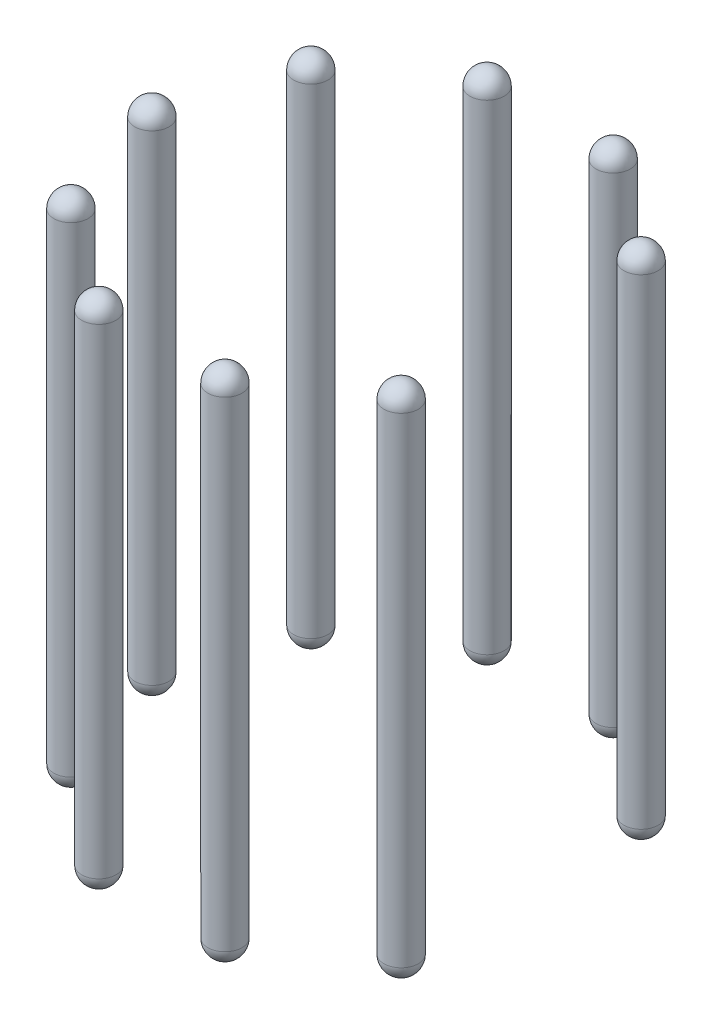
ISO-10303-21;
HEADER;
FILE_DESCRIPTION(('STEP AP214'),'2;1');
FILE_NAME('part.step','',(''),(''),'','','');
FILE_SCHEMA(('AUTOMOTIVE_DESIGN { 1 0 10303 214 1 1 1 1 }'));
ENDSEC;
DATA;
#1=APPLICATION_CONTEXT('core data for automotive mechanical design processes');
#2=APPLICATION_PROTOCOL_DEFINITION('international standard','automotive_design',2000,#1);
#3=PRODUCT_CONTEXT('',#1,'mechanical');
#4=PRODUCT('Part','Part','',(#3));
#5=PRODUCT_RELATED_PRODUCT_CATEGORY('part','',(#4));
#6=PRODUCT_DEFINITION_FORMATION('','',#4);
#7=PRODUCT_DEFINITION_CONTEXT('part definition',#1,'design');
#8=PRODUCT_DEFINITION('design','',#6,#7);
#9=PRODUCT_DEFINITION_SHAPE('','',#8);
#10=(LENGTH_UNIT() NAMED_UNIT(*) SI_UNIT(.MILLI.,.METRE.));
#11=(NAMED_UNIT(*) PLANE_ANGLE_UNIT() SI_UNIT($,.RADIAN.));
#12=(NAMED_UNIT(*) SI_UNIT($,.STERADIAN.) SOLID_ANGLE_UNIT());
#13=UNCERTAINTY_MEASURE_WITH_UNIT(LENGTH_MEASURE(1.E-05),#10,'distance_accuracy_value','');
#14=(GEOMETRIC_REPRESENTATION_CONTEXT(3) GLOBAL_UNCERTAINTY_ASSIGNED_CONTEXT((#13)) GLOBAL_UNIT_ASSIGNED_CONTEXT((#10,
#11,#12)) REPRESENTATION_CONTEXT('',''));
#15=CARTESIAN_POINT('',(0.,0.,0.));
#16=DIRECTION('',(0.,0.,1.));
#17=DIRECTION('',(1.,0.,0.));
#18=AXIS2_PLACEMENT_3D('',#15,#16,#17);
#19=CARTESIAN_POINT('',(4.81365111653094,8.,3.49732225114022));
#20=DIRECTION('',(0.,-1.,0.));
#21=DIRECTION('',(0.809016994374947,0.,0.587785252292473));
#22=AXIS2_PLACEMENT_3D('',#19,#20,#21);
#23=SPHERICAL_SURFACE('',#22,0.5);
#24=CARTESIAN_POINT('',(4.81365111653094,8.,3.49732225114022));
#25=DIRECTION('',(0.,-1.,0.));
#26=DIRECTION('',(0.,0.,-1.));
#27=AXIS2_PLACEMENT_3D('',#24,#25,#26);
#28=CIRCLE('',#27,0.499999999999999);
#29=CARTESIAN_POINT('',(4.81365111653094,8.,2.99732225114022));
#30=VERTEX_POINT('',#29);
#31=EDGE_CURVE('E45',#30,#30,#28,.T.);
#32=ORIENTED_EDGE('',*,*,#31,.F.);
#33=EDGE_LOOP('',(#32));
#34=FACE_BOUND('',#33,.T.);
#35=ADVANCED_FACE('F39',(#34),#23,.T.);
#36=CARTESIAN_POINT('',(4.81365111653094,-6.,3.49732225114022));
#37=DIRECTION('',(0.,-1.,0.));
#38=DIRECTION('',(-0.809016994374947,0.,-0.587785252292473));
#39=AXIS2_PLACEMENT_3D('',#36,#37,#38);
#40=SPHERICAL_SURFACE('',#39,0.499999999999999);
#41=CARTESIAN_POINT('',(4.81365111653094,-6.,3.49732225114022));
#42=DIRECTION('',(0.,-1.,0.));
#43=DIRECTION('',(0.,0.,-1.));
#44=AXIS2_PLACEMENT_3D('',#41,#42,#43);
#45=CIRCLE('',#44,0.499999999999999);
#46=CARTESIAN_POINT('',(4.81365111653094,-6.,2.99732225114022));
#47=VERTEX_POINT('',#46);
#48=EDGE_CURVE('E11',#47,#47,#45,.T.);
#49=ORIENTED_EDGE('',*,*,#48,.T.);
#50=EDGE_LOOP('',(#49));
#51=FACE_BOUND('',#50,.T.);
#52=ADVANCED_FACE('F55',(#51),#40,.T.);
#53=CARTESIAN_POINT('',(4.81365111653094,-7.25,3.49732225114022));
#54=DIRECTION('',(0.,-1.,0.));
#55=DIRECTION('',(0.,0.,-1.));
#56=AXIS2_PLACEMENT_3D('',#53,#54,#55);
#57=CYLINDRICAL_SURFACE('',#56,0.499999999999999);
#58=ORIENTED_EDGE('',*,*,#31,.T.);
#59=EDGE_LOOP('',(#58));
#60=FACE_BOUND('',#59,.T.);
#61=ORIENTED_EDGE('',*,*,#48,.F.);
#62=EDGE_LOOP('',(#61));
#63=FACE_BOUND('',#62,.T.);
#64=ADVANCED_FACE('F51',(#60,#63),#57,.T.);
#65=CLOSED_SHELL('',(#35,#52,#64));
#66=MANIFOLD_SOLID_BREP('B2',#65);
#67=CARTESIAN_POINT('',(1.83865111653094,8.,5.65878627195616));
#68=DIRECTION('',(0.,-1.,0.));
#69=DIRECTION('',(0.309016994374947,0.,0.951056516295154));
#70=AXIS2_PLACEMENT_3D('',#67,#68,#69);
#71=SPHERICAL_SURFACE('',#70,0.5);
#72=CARTESIAN_POINT('',(1.83865111653094,8.,5.65878627195616));
#73=DIRECTION('',(0.,-1.,0.));
#74=DIRECTION('',(0.,0.,-1.));
#75=AXIS2_PLACEMENT_3D('',#72,#73,#74);
#76=CIRCLE('',#75,0.5);
#77=CARTESIAN_POINT('',(1.83865111653094,8.,5.15878627195616));
#78=VERTEX_POINT('',#77);
#79=EDGE_CURVE('E93',#78,#78,#76,.T.);
#80=ORIENTED_EDGE('',*,*,#79,.F.);
#81=EDGE_LOOP('',(#80));
#82=FACE_BOUND('',#81,.T.);
#83=ADVANCED_FACE('F87',(#82),#71,.T.);
#84=CARTESIAN_POINT('',(1.83865111653094,-6.,5.65878627195616));
#85=DIRECTION('',(0.,-1.,0.));
#86=DIRECTION('',(-0.309016994374947,0.,-0.951056516295154));
#87=AXIS2_PLACEMENT_3D('',#84,#85,#86);
#88=SPHERICAL_SURFACE('',#87,0.5);
#89=CARTESIAN_POINT('',(1.83865111653094,-6.,5.65878627195616));
#90=DIRECTION('',(0.,-1.,0.));
#91=DIRECTION('',(0.,0.,-1.));
#92=AXIS2_PLACEMENT_3D('',#89,#90,#91);
#93=CIRCLE('',#92,0.5);
#94=CARTESIAN_POINT('',(1.83865111653094,-6.,5.15878627195616));
#95=VERTEX_POINT('',#94);
#96=EDGE_CURVE('E38',#95,#95,#93,.T.);
#97=ORIENTED_EDGE('',*,*,#96,.T.);
#98=EDGE_LOOP('',(#97));
#99=FACE_BOUND('',#98,.T.);
#100=ADVANCED_FACE('F103',(#99),#88,.T.);
#101=CARTESIAN_POINT('',(1.83865111653094,-7.25,5.65878627195616));
#102=DIRECTION('',(0.,-1.,0.));
#103=DIRECTION('',(0.,0.,-1.));
#104=AXIS2_PLACEMENT_3D('',#101,#102,#103);
#105=CYLINDRICAL_SURFACE('',#104,0.5);
#106=ORIENTED_EDGE('',*,*,#79,.T.);
#107=EDGE_LOOP('',(#106));
#108=FACE_BOUND('',#107,.T.);
#109=ORIENTED_EDGE('',*,*,#96,.F.);
#110=EDGE_LOOP('',(#109));
#111=FACE_BOUND('',#110,.T.);
#112=ADVANCED_FACE('F99',(#108,#111),#105,.T.);
#113=CLOSED_SHELL('',(#83,#100,#112));
#114=MANIFOLD_SOLID_BREP('B6',#113);
#115=CARTESIAN_POINT('',(-1.83865111653094,8.,5.65878627195617));
#116=DIRECTION('',(0.,-1.,0.));
#117=DIRECTION('',(-0.309016994374948,0.,0.951056516295154));
#118=AXIS2_PLACEMENT_3D('',#115,#116,#117);
#119=SPHERICAL_SURFACE('',#118,0.5);
#120=CARTESIAN_POINT('',(-1.83865111653094,8.,5.65878627195617));
#121=DIRECTION('',(0.,-1.,0.));
#122=DIRECTION('',(0.,0.,-1.));
#123=AXIS2_PLACEMENT_3D('',#120,#121,#122);
#124=CIRCLE('',#123,0.5);
#125=CARTESIAN_POINT('',(-1.83865111653094,8.,5.15878627195617));
#126=VERTEX_POINT('',#125);
#127=EDGE_CURVE('E141',#126,#126,#124,.T.);
#128=ORIENTED_EDGE('',*,*,#127,.F.);
#129=EDGE_LOOP('',(#128));
#130=FACE_BOUND('',#129,.T.);
#131=ADVANCED_FACE('F135',(#130),#119,.T.);
#132=CARTESIAN_POINT('',(-1.83865111653094,-6.,5.65878627195617));
#133=DIRECTION('',(0.,-1.,0.));
#134=DIRECTION('',(0.309016994374948,0.,-0.951056516295154));
#135=AXIS2_PLACEMENT_3D('',#132,#133,#134);
#136=SPHERICAL_SURFACE('',#135,0.5);
#137=CARTESIAN_POINT('',(-1.83865111653094,-6.,5.65878627195617));
#138=DIRECTION('',(0.,-1.,0.));
#139=DIRECTION('',(0.,0.,-1.));
#140=AXIS2_PLACEMENT_3D('',#137,#138,#139);
#141=CIRCLE('',#140,0.5);
#142=CARTESIAN_POINT('',(-1.83865111653094,-6.,5.15878627195617));
#143=VERTEX_POINT('',#142);
#144=EDGE_CURVE('E86',#143,#143,#141,.T.);
#145=ORIENTED_EDGE('',*,*,#144,.T.);
#146=EDGE_LOOP('',(#145));
#147=FACE_BOUND('',#146,.T.);
#148=ADVANCED_FACE('F151',(#147),#136,.T.);
#149=CARTESIAN_POINT('',(-1.83865111653094,-7.25,5.65878627195617));
#150=DIRECTION('',(0.,-1.,0.));
#151=DIRECTION('',(0.,0.,-1.));
#152=AXIS2_PLACEMENT_3D('',#149,#150,#151);
#153=CYLINDRICAL_SURFACE('',#152,0.5);
#154=ORIENTED_EDGE('',*,*,#127,.T.);
#155=EDGE_LOOP('',(#154));
#156=FACE_BOUND('',#155,.T.);
#157=ORIENTED_EDGE('',*,*,#144,.F.);
#158=EDGE_LOOP('',(#157));
#159=FACE_BOUND('',#158,.T.);
#160=ADVANCED_FACE('F147',(#156,#159),#153,.T.);
#161=CLOSED_SHELL('',(#131,#148,#160));
#162=MANIFOLD_SOLID_BREP('B33',#161);
#163=CARTESIAN_POINT('',(-4.81365111653094,8.,3.49732225114021));
#164=DIRECTION('',(0.,-1.,0.));
#165=DIRECTION('',(-0.809016994374948,0.,0.587785252292473));
#166=AXIS2_PLACEMENT_3D('',#163,#164,#165);
#167=SPHERICAL_SURFACE('',#166,0.5);
#168=CARTESIAN_POINT('',(-4.81365111653094,8.,3.49732225114021));
#169=DIRECTION('',(0.,-1.,0.));
#170=DIRECTION('',(0.,0.,-1.));
#171=AXIS2_PLACEMENT_3D('',#168,#169,#170);
#172=CIRCLE('',#171,0.499999999999999);
#173=CARTESIAN_POINT('',(-4.81365111653094,8.,2.99732225114022));
#174=VERTEX_POINT('',#173);
#175=EDGE_CURVE('E189',#174,#174,#172,.T.);
#176=ORIENTED_EDGE('',*,*,#175,.F.);
#177=EDGE_LOOP('',(#176));
#178=FACE_BOUND('',#177,.T.);
#179=ADVANCED_FACE('F183',(#178),#167,.T.);
#180=CARTESIAN_POINT('',(-4.81365111653094,-6.,3.49732225114021));
#181=DIRECTION('',(0.,-1.,0.));
#182=DIRECTION('',(0.809016994374948,0.,-0.587785252292473));
#183=AXIS2_PLACEMENT_3D('',#180,#181,#182);
#184=SPHERICAL_SURFACE('',#183,0.499999999999999);
#185=CARTESIAN_POINT('',(-4.81365111653094,-6.,3.49732225114021));
#186=DIRECTION('',(0.,-1.,0.));
#187=DIRECTION('',(0.,0.,-1.));
#188=AXIS2_PLACEMENT_3D('',#185,#186,#187);
#189=CIRCLE('',#188,0.499999999999999);
#190=CARTESIAN_POINT('',(-4.81365111653094,-6.,2.99732225114022));
#191=VERTEX_POINT('',#190);
#192=EDGE_CURVE('E134',#191,#191,#189,.T.);
#193=ORIENTED_EDGE('',*,*,#192,.T.);
#194=EDGE_LOOP('',(#193));
#195=FACE_BOUND('',#194,.T.);
#196=ADVANCED_FACE('F199',(#195),#184,.T.);
#197=CARTESIAN_POINT('',(-4.81365111653094,-7.25,3.49732225114021));
#198=DIRECTION('',(0.,-1.,0.));
#199=DIRECTION('',(0.,0.,-1.));
#200=AXIS2_PLACEMENT_3D('',#197,#198,#199);
#201=CYLINDRICAL_SURFACE('',#200,0.499999999999999);
#202=ORIENTED_EDGE('',*,*,#175,.T.);
#203=EDGE_LOOP('',(#202));
#204=FACE_BOUND('',#203,.T.);
#205=ORIENTED_EDGE('',*,*,#192,.F.);
#206=EDGE_LOOP('',(#205));
#207=FACE_BOUND('',#206,.T.);
#208=ADVANCED_FACE('F195',(#204,#207),#201,.T.);
#209=CLOSED_SHELL('',(#179,#196,#208));
#210=MANIFOLD_SOLID_BREP('B81',#209);
#211=CARTESIAN_POINT('',(-5.95,8.,0.));
#212=DIRECTION('',(0.,-1.,0.));
#213=DIRECTION('',(-1.,0.,0.));
#214=AXIS2_PLACEMENT_3D('',#211,#212,#213);
#215=SPHERICAL_SURFACE('',#214,0.5);
#216=CARTESIAN_POINT('',(-5.95,8.,0.));
#217=DIRECTION('',(0.,-1.,0.));
#218=DIRECTION('',(0.,0.,-1.));
#219=AXIS2_PLACEMENT_3D('',#216,#217,#218);
#220=CIRCLE('',#219,0.5);
#221=CARTESIAN_POINT('',(-5.95,8.,-0.5));
#222=VERTEX_POINT('',#221);
#223=EDGE_CURVE('E237',#222,#222,#220,.T.);
#224=ORIENTED_EDGE('',*,*,#223,.F.);
#225=EDGE_LOOP('',(#224));
#226=FACE_BOUND('',#225,.T.);
#227=ADVANCED_FACE('F231',(#226),#215,.T.);
#228=CARTESIAN_POINT('',(-5.95,-6.,0.));
#229=DIRECTION('',(0.,-1.,0.));
#230=DIRECTION('',(1.,0.,0.));
#231=AXIS2_PLACEMENT_3D('',#228,#229,#230);
#232=SPHERICAL_SURFACE('',#231,0.5);
#233=CARTESIAN_POINT('',(-5.95,-6.,0.));
#234=DIRECTION('',(0.,-1.,0.));
#235=DIRECTION('',(0.,0.,-1.));
#236=AXIS2_PLACEMENT_3D('',#233,#234,#235);
#237=CIRCLE('',#236,0.5);
#238=CARTESIAN_POINT('',(-5.95,-6.,-0.5));
#239=VERTEX_POINT('',#238);
#240=EDGE_CURVE('E182',#239,#239,#237,.T.);
#241=ORIENTED_EDGE('',*,*,#240,.T.);
#242=EDGE_LOOP('',(#241));
#243=FACE_BOUND('',#242,.T.);
#244=ADVANCED_FACE('F247',(#243),#232,.T.);
#245=CARTESIAN_POINT('',(-5.95,-7.25,0.));
#246=DIRECTION('',(0.,-1.,0.));
#247=DIRECTION('',(0.,0.,-1.));
#248=AXIS2_PLACEMENT_3D('',#245,#246,#247);
#249=CYLINDRICAL_SURFACE('',#248,0.5);
#250=ORIENTED_EDGE('',*,*,#223,.T.);
#251=EDGE_LOOP('',(#250));
#252=FACE_BOUND('',#251,.T.);
#253=ORIENTED_EDGE('',*,*,#240,.F.);
#254=EDGE_LOOP('',(#253));
#255=FACE_BOUND('',#254,.T.);
#256=ADVANCED_FACE('F243',(#252,#255),#249,.T.);
#257=CLOSED_SHELL('',(#227,#244,#256));
#258=MANIFOLD_SOLID_BREP('B129',#257);
#259=CARTESIAN_POINT('',(-4.81365111653094,8.,-3.49732225114022));
#260=DIRECTION('',(0.,-1.,0.));
#261=DIRECTION('',(-0.809016994374947,0.,-0.587785252292473));
#262=AXIS2_PLACEMENT_3D('',#259,#260,#261);
#263=SPHERICAL_SURFACE('',#262,0.5);
#264=CARTESIAN_POINT('',(-4.81365111653094,8.,-3.49732225114022));
#265=DIRECTION('',(0.,-1.,0.));
#266=DIRECTION('',(0.,0.,-1.));
#267=AXIS2_PLACEMENT_3D('',#264,#265,#266);
#268=CIRCLE('',#267,0.499999999999999);
#269=CARTESIAN_POINT('',(-4.81365111653094,8.,-3.99732225114021));
#270=VERTEX_POINT('',#269);
#271=EDGE_CURVE('E285',#270,#270,#268,.T.);
#272=ORIENTED_EDGE('',*,*,#271,.F.);
#273=EDGE_LOOP('',(#272));
#274=FACE_BOUND('',#273,.T.);
#275=ADVANCED_FACE('F279',(#274),#263,.T.);
#276=CARTESIAN_POINT('',(-4.81365111653094,-6.,-3.49732225114022));
#277=DIRECTION('',(0.,-1.,0.));
#278=DIRECTION('',(0.809016994374947,0.,0.587785252292473));
#279=AXIS2_PLACEMENT_3D('',#276,#277,#278);
#280=SPHERICAL_SURFACE('',#279,0.499999999999999);
#281=CARTESIAN_POINT('',(-4.81365111653094,-6.,-3.49732225114022));
#282=DIRECTION('',(0.,-1.,0.));
#283=DIRECTION('',(0.,0.,-1.));
#284=AXIS2_PLACEMENT_3D('',#281,#282,#283);
#285=CIRCLE('',#284,0.499999999999999);
#286=CARTESIAN_POINT('',(-4.81365111653094,-6.,-3.99732225114021));
#287=VERTEX_POINT('',#286);
#288=EDGE_CURVE('E230',#287,#287,#285,.T.);
#289=ORIENTED_EDGE('',*,*,#288,.T.);
#290=EDGE_LOOP('',(#289));
#291=FACE_BOUND('',#290,.T.);
#292=ADVANCED_FACE('F295',(#291),#280,.T.);
#293=CARTESIAN_POINT('',(-4.81365111653094,-7.25,-3.49732225114022));
#294=DIRECTION('',(0.,-1.,0.));
#295=DIRECTION('',(0.,0.,-1.));
#296=AXIS2_PLACEMENT_3D('',#293,#294,#295);
#297=CYLINDRICAL_SURFACE('',#296,0.499999999999999);
#298=ORIENTED_EDGE('',*,*,#271,.T.);
#299=EDGE_LOOP('',(#298));
#300=FACE_BOUND('',#299,.T.);
#301=ORIENTED_EDGE('',*,*,#288,.F.);
#302=EDGE_LOOP('',(#301));
#303=FACE_BOUND('',#302,.T.);
#304=ADVANCED_FACE('F291',(#300,#303),#297,.T.);
#305=CLOSED_SHELL('',(#275,#292,#304));
#306=MANIFOLD_SOLID_BREP('B177',#305);
#307=CARTESIAN_POINT('',(-1.83865111653094,8.,-5.65878627195616));
#308=DIRECTION('',(0.,-1.,0.));
#309=DIRECTION('',(-0.309016994374947,0.,-0.951056516295154));
#310=AXIS2_PLACEMENT_3D('',#307,#308,#309);
#311=SPHERICAL_SURFACE('',#310,0.5);
#312=CARTESIAN_POINT('',(-1.83865111653094,8.,-5.65878627195616));
#313=DIRECTION('',(0.,-1.,0.));
#314=DIRECTION('',(0.,0.,-1.));
#315=AXIS2_PLACEMENT_3D('',#312,#313,#314);
#316=CIRCLE('',#315,0.5);
#317=CARTESIAN_POINT('',(-1.83865111653094,8.,-6.15878627195616));
#318=VERTEX_POINT('',#317);
#319=EDGE_CURVE('E333',#318,#318,#316,.T.);
#320=ORIENTED_EDGE('',*,*,#319,.F.);
#321=EDGE_LOOP('',(#320));
#322=FACE_BOUND('',#321,.T.);
#323=ADVANCED_FACE('F327',(#322),#311,.T.);
#324=CARTESIAN_POINT('',(-1.83865111653094,-6.,-5.65878627195616));
#325=DIRECTION('',(0.,-1.,0.));
#326=DIRECTION('',(0.309016994374947,0.,0.951056516295154));
#327=AXIS2_PLACEMENT_3D('',#324,#325,#326);
#328=SPHERICAL_SURFACE('',#327,0.5);
#329=CARTESIAN_POINT('',(-1.83865111653094,-6.,-5.65878627195616));
#330=DIRECTION('',(0.,-1.,0.));
#331=DIRECTION('',(0.,0.,-1.));
#332=AXIS2_PLACEMENT_3D('',#329,#330,#331);
#333=CIRCLE('',#332,0.5);
#334=CARTESIAN_POINT('',(-1.83865111653094,-6.,-6.15878627195616));
#335=VERTEX_POINT('',#334);
#336=EDGE_CURVE('E278',#335,#335,#333,.T.);
#337=ORIENTED_EDGE('',*,*,#336,.T.);
#338=EDGE_LOOP('',(#337));
#339=FACE_BOUND('',#338,.T.);
#340=ADVANCED_FACE('F343',(#339),#328,.T.);
#341=CARTESIAN_POINT('',(-1.83865111653094,-7.25,-5.65878627195616));
#342=DIRECTION('',(0.,-1.,0.));
#343=DIRECTION('',(0.,0.,-1.));
#344=AXIS2_PLACEMENT_3D('',#341,#342,#343);
#345=CYLINDRICAL_SURFACE('',#344,0.5);
#346=ORIENTED_EDGE('',*,*,#319,.T.);
#347=EDGE_LOOP('',(#346));
#348=FACE_BOUND('',#347,.T.);
#349=ORIENTED_EDGE('',*,*,#336,.F.);
#350=EDGE_LOOP('',(#349));
#351=FACE_BOUND('',#350,.T.);
#352=ADVANCED_FACE('F339',(#348,#351),#345,.T.);
#353=CLOSED_SHELL('',(#323,#340,#352));
#354=MANIFOLD_SOLID_BREP('B225',#353);
#355=CARTESIAN_POINT('',(1.83865111653094,8.,-5.65878627195617));
#356=DIRECTION('',(0.,-1.,0.));
#357=DIRECTION('',(0.309016994374948,0.,-0.951056516295154));
#358=AXIS2_PLACEMENT_3D('',#355,#356,#357);
#359=SPHERICAL_SURFACE('',#358,0.5);
#360=CARTESIAN_POINT('',(1.83865111653094,8.,-5.65878627195617));
#361=DIRECTION('',(0.,-1.,0.));
#362=DIRECTION('',(0.,0.,-1.));
#363=AXIS2_PLACEMENT_3D('',#360,#361,#362);
#364=CIRCLE('',#363,0.5);
#365=CARTESIAN_POINT('',(1.83865111653094,8.,-6.15878627195617));
#366=VERTEX_POINT('',#365);
#367=EDGE_CURVE('E380',#366,#366,#364,.T.);
#368=ORIENTED_EDGE('',*,*,#367,.F.);
#369=EDGE_LOOP('',(#368));
#370=FACE_BOUND('',#369,.T.);
#371=ADVANCED_FACE('F374',(#370),#359,.T.);
#372=CARTESIAN_POINT('',(1.83865111653094,-6.,-5.65878627195617));
#373=DIRECTION('',(0.,-1.,0.));
#374=DIRECTION('',(-0.309016994374948,0.,0.951056516295154));
#375=AXIS2_PLACEMENT_3D('',#372,#373,#374);
#376=SPHERICAL_SURFACE('',#375,0.5);
#377=CARTESIAN_POINT('',(1.83865111653094,-6.,-5.65878627195617));
#378=DIRECTION('',(0.,-1.,0.));
#379=DIRECTION('',(0.,0.,-1.));
#380=AXIS2_PLACEMENT_3D('',#377,#378,#379);
#381=CIRCLE('',#380,0.5);
#382=CARTESIAN_POINT('',(1.83865111653094,-6.,-6.15878627195617));
#383=VERTEX_POINT('',#382);
#384=EDGE_CURVE('E326',#383,#383,#381,.T.);
#385=ORIENTED_EDGE('',*,*,#384,.T.);
#386=EDGE_LOOP('',(#385));
#387=FACE_BOUND('',#386,.T.);
#388=ADVANCED_FACE('F390',(#387),#376,.T.);
#389=CARTESIAN_POINT('',(1.83865111653094,-7.25,-5.65878627195617));
#390=DIRECTION('',(0.,-1.,0.));
#391=DIRECTION('',(0.,0.,-1.));
#392=AXIS2_PLACEMENT_3D('',#389,#390,#391);
#393=CYLINDRICAL_SURFACE('',#392,0.5);
#394=ORIENTED_EDGE('',*,*,#367,.T.);
#395=EDGE_LOOP('',(#394));
#396=FACE_BOUND('',#395,.T.);
#397=ORIENTED_EDGE('',*,*,#384,.F.);
#398=EDGE_LOOP('',(#397));
#399=FACE_BOUND('',#398,.T.);
#400=ADVANCED_FACE('F386',(#396,#399),#393,.T.);
#401=CLOSED_SHELL('',(#371,#388,#400));
#402=MANIFOLD_SOLID_BREP('B273',#401);
#403=CARTESIAN_POINT('',(4.81365111653094,8.,-3.49732225114022));
#404=DIRECTION('',(0.,-1.,0.));
#405=DIRECTION('',(0.809016994374948,0.,-0.587785252292473));
#406=AXIS2_PLACEMENT_3D('',#403,#404,#405);
#407=SPHERICAL_SURFACE('',#406,0.5);
#408=CARTESIAN_POINT('',(4.81365111653094,8.,-3.49732225114022));
#409=DIRECTION('',(0.,-1.,0.));
#410=DIRECTION('',(0.,0.,-1.));
#411=AXIS2_PLACEMENT_3D('',#408,#409,#410);
#412=CIRCLE('',#411,0.5);
#413=CARTESIAN_POINT('',(4.81365111653094,8.,-3.99732225114022));
#414=VERTEX_POINT('',#413);
#415=EDGE_CURVE('E420',#414,#414,#412,.T.);
#416=ORIENTED_EDGE('',*,*,#415,.F.);
#417=EDGE_LOOP('',(#416));
#418=FACE_BOUND('',#417,.T.);
#419=ADVANCED_FACE('F414',(#418),#407,.T.);
#420=CARTESIAN_POINT('',(4.81365111653094,-6.,-3.49732225114022));
#421=DIRECTION('',(0.,-1.,0.));
#422=DIRECTION('',(-0.809016994374948,0.,0.587785252292473));
#423=AXIS2_PLACEMENT_3D('',#420,#421,#422);
#424=SPHERICAL_SURFACE('',#423,0.5);
#425=CARTESIAN_POINT('',(4.81365111653094,-6.,-3.49732225114022));
#426=DIRECTION('',(0.,-1.,0.));
#427=DIRECTION('',(0.,0.,-1.));
#428=AXIS2_PLACEMENT_3D('',#425,#426,#427);
#429=CIRCLE('',#428,0.5);
#430=CARTESIAN_POINT('',(4.81365111653094,-6.,-3.99732225114022));
#431=VERTEX_POINT('',#430);
#432=EDGE_CURVE('E373',#431,#431,#429,.T.);
#433=ORIENTED_EDGE('',*,*,#432,.T.);
#434=EDGE_LOOP('',(#433));
#435=FACE_BOUND('',#434,.T.);
#436=ADVANCED_FACE('F430',(#435),#424,.T.);
#437=CARTESIAN_POINT('',(4.81365111653094,-7.25,-3.49732225114022));
#438=DIRECTION('',(0.,-1.,0.));
#439=DIRECTION('',(0.,0.,-1.));
#440=AXIS2_PLACEMENT_3D('',#437,#438,#439);
#441=CYLINDRICAL_SURFACE('',#440,0.5);
#442=ORIENTED_EDGE('',*,*,#415,.T.);
#443=EDGE_LOOP('',(#442));
#444=FACE_BOUND('',#443,.T.);
#445=ORIENTED_EDGE('',*,*,#432,.F.);
#446=EDGE_LOOP('',(#445));
#447=FACE_BOUND('',#446,.T.);
#448=ADVANCED_FACE('F426',(#444,#447),#441,.T.);
#449=CLOSED_SHELL('',(#419,#436,#448));
#450=MANIFOLD_SOLID_BREP('B321',#449);
#451=ADVANCED_BREP_SHAPE_REPRESENTATION('',(#18,#66,#114,#162,#210,#258,#306,#354,#402,#450),#14);
#452=SHAPE_DEFINITION_REPRESENTATION(#9,#451);
ENDSEC;
END-ISO-10303-21;
